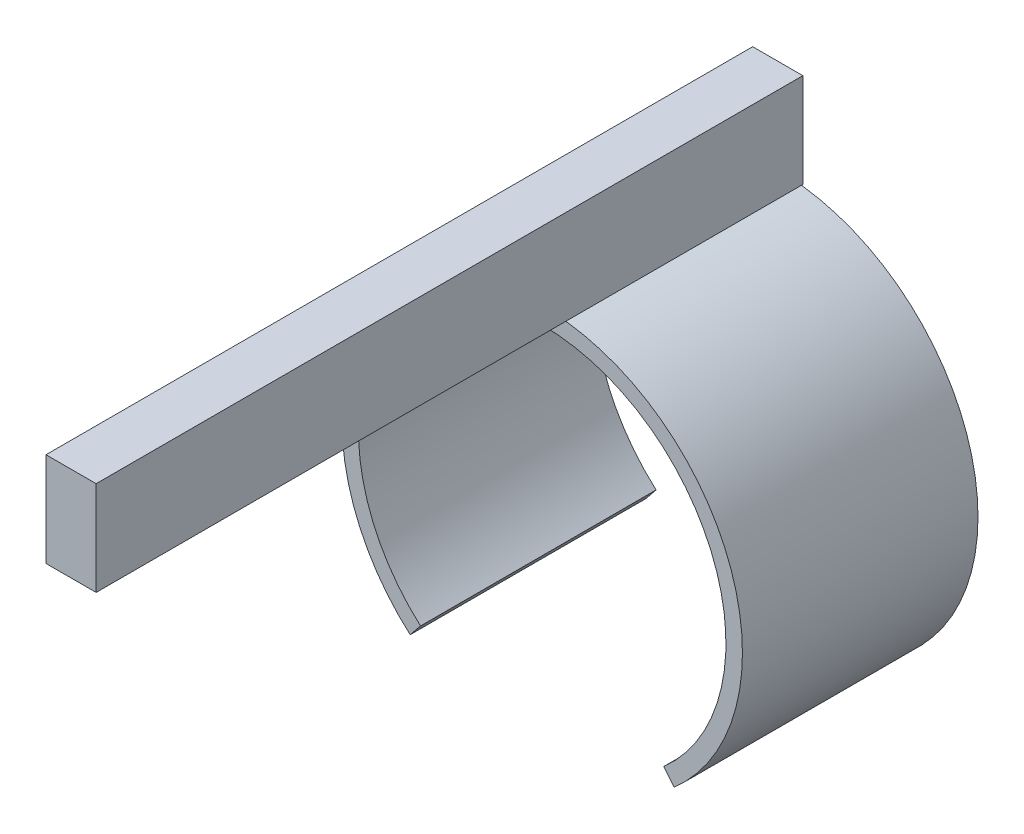
ISO-10303-21;
HEADER;
FILE_DESCRIPTION(('STEP AP214'),'2;1');
FILE_NAME('part.step','',(''),(''),'','','');
FILE_SCHEMA(('AUTOMOTIVE_DESIGN { 1 0 10303 214 1 1 1 1 }'));
ENDSEC;
DATA;
#1=APPLICATION_CONTEXT('core data for automotive mechanical design processes');
#2=APPLICATION_PROTOCOL_DEFINITION('international standard','automotive_design',2000,#1);
#3=PRODUCT_CONTEXT('',#1,'mechanical');
#4=PRODUCT('Part','Part','',(#3));
#5=PRODUCT_RELATED_PRODUCT_CATEGORY('part','',(#4));
#6=PRODUCT_DEFINITION_FORMATION('','',#4);
#7=PRODUCT_DEFINITION_CONTEXT('part definition',#1,'design');
#8=PRODUCT_DEFINITION('design','',#6,#7);
#9=PRODUCT_DEFINITION_SHAPE('','',#8);
#10=(LENGTH_UNIT() NAMED_UNIT(*) SI_UNIT(.MILLI.,.METRE.));
#11=(NAMED_UNIT(*) PLANE_ANGLE_UNIT() SI_UNIT($,.RADIAN.));
#12=(NAMED_UNIT(*) SI_UNIT($,.STERADIAN.) SOLID_ANGLE_UNIT());
#13=UNCERTAINTY_MEASURE_WITH_UNIT(LENGTH_MEASURE(1.E-05),#10,'distance_accuracy_value','');
#14=(GEOMETRIC_REPRESENTATION_CONTEXT(3) GLOBAL_UNCERTAINTY_ASSIGNED_CONTEXT((#13)) GLOBAL_UNIT_ASSIGNED_CONTEXT((#10,
#11,#12)) REPRESENTATION_CONTEXT('',''));
#15=CARTESIAN_POINT('',(0.,0.,0.));
#16=DIRECTION('',(0.,0.,1.));
#17=DIRECTION('',(1.,0.,0.));
#18=AXIS2_PLACEMENT_3D('',#15,#16,#17);
#19=CARTESIAN_POINT('',(-0.532070741142381,6.25,0.));
#20=DIRECTION('',(1.,0.,0.));
#21=DIRECTION('',(0.,0.,-1.));
#22=AXIS2_PLACEMENT_3D('',#19,#20,#21);
#23=PLANE('',#22);
#24=DIRECTION('',(0.,0.,1.));
#25=VECTOR('',#24,1.);
#26=CARTESIAN_POINT('',(-0.532070741142381,4.25,0.));
#27=LINE('',#26,#25);
#28=CARTESIAN_POINT('',(-0.532070741142381,4.25,0.));
#29=VERTEX_POINT('',#28);
#30=CARTESIAN_POINT('',(-0.532070741142381,4.25,15.));
#31=VERTEX_POINT('',#30);
#32=EDGE_CURVE('E91',#29,#31,#27,.T.);
#33=ORIENTED_EDGE('',*,*,#32,.T.);
#34=DIRECTION('',(0.,-1.,0.));
#35=VECTOR('',#34,1.);
#36=CARTESIAN_POINT('',(-0.532070741142381,6.25,15.));
#37=LINE('',#36,#35);
#38=CARTESIAN_POINT('',(-0.532070741142381,6.25,15.));
#39=VERTEX_POINT('',#38);
#40=EDGE_CURVE('E94',#39,#31,#37,.T.);
#41=ORIENTED_EDGE('',*,*,#40,.F.);
#42=DIRECTION('',(0.,0.,1.));
#43=VECTOR('',#42,1.);
#44=CARTESIAN_POINT('',(-0.532070741142381,6.25,0.));
#45=LINE('',#44,#43);
#46=CARTESIAN_POINT('',(-0.532070741142381,6.25,0.));
#47=VERTEX_POINT('',#46);
#48=EDGE_CURVE('E78',#47,#39,#45,.T.);
#49=ORIENTED_EDGE('',*,*,#48,.F.);
#50=DIRECTION('',(0.,-1.,0.));
#51=VECTOR('',#50,1.);
#52=CARTESIAN_POINT('',(-0.532070741142381,6.25,0.));
#53=LINE('',#52,#51);
#54=EDGE_CURVE('E54',#47,#29,#53,.T.);
#55=ORIENTED_EDGE('',*,*,#54,.T.);
#56=EDGE_LOOP('',(#33,#41,#49,#55));
#57=FACE_BOUND('',#56,.T.);
#58=ADVANCED_FACE('F46',(#57),#23,.F.);
#59=CARTESIAN_POINT('',(0.532070741142382,6.25,0.));
#60=DIRECTION('',(-1.,0.,0.));
#61=DIRECTION('',(0.,0.,1.));
#62=AXIS2_PLACEMENT_3D('',#59,#60,#61);
#63=PLANE('',#62);
#64=DIRECTION('',(0.,0.,-1.));
#65=VECTOR('',#64,1.);
#66=CARTESIAN_POINT('',(0.532070741142382,4.25,0.));
#67=LINE('',#66,#65);
#68=CARTESIAN_POINT('',(0.532070741142382,4.25,15.));
#69=VERTEX_POINT('',#68);
#70=CARTESIAN_POINT('',(0.532070741142382,4.25,0.));
#71=VERTEX_POINT('',#70);
#72=EDGE_CURVE('E73',#69,#71,#67,.T.);
#73=ORIENTED_EDGE('',*,*,#72,.T.);
#74=DIRECTION('',(0.,-1.,0.));
#75=VECTOR('',#74,1.);
#76=CARTESIAN_POINT('',(0.532070741142382,6.25,0.));
#77=LINE('',#76,#75);
#78=CARTESIAN_POINT('',(0.532070741142382,6.25,0.));
#79=VERTEX_POINT('',#78);
#80=EDGE_CURVE('E12',#79,#71,#77,.T.);
#81=ORIENTED_EDGE('',*,*,#80,.F.);
#82=DIRECTION('',(0.,0.,-1.));
#83=VECTOR('',#82,1.);
#84=CARTESIAN_POINT('',(0.532070741142382,6.25,0.));
#85=LINE('',#84,#83);
#86=CARTESIAN_POINT('',(0.532070741142382,6.25,15.));
#87=VERTEX_POINT('',#86);
#88=EDGE_CURVE('E112',#87,#79,#85,.T.);
#89=ORIENTED_EDGE('',*,*,#88,.F.);
#90=DIRECTION('',(0.,1.,0.));
#91=VECTOR('',#90,1.);
#92=CARTESIAN_POINT('',(0.532070741142382,4.25,15.));
#93=LINE('',#92,#91);
#94=EDGE_CURVE('E104',#69,#87,#93,.T.);
#95=ORIENTED_EDGE('',*,*,#94,.F.);
#96=EDGE_LOOP('',(#73,#81,#89,#95));
#97=FACE_BOUND('',#96,.T.);
#98=ADVANCED_FACE('F119',(#97),#63,.F.);
#99=CARTESIAN_POINT('',(-0.532070741142381,6.25,0.));
#100=DIRECTION('',(0.,0.,1.));
#101=DIRECTION('',(1.,0.,0.));
#102=AXIS2_PLACEMENT_3D('',#99,#100,#101);
#103=PLANE('',#102);
#104=DIRECTION('',(-1.,0.,0.));
#105=VECTOR('',#104,1.);
#106=CARTESIAN_POINT('',(-0.532070741142381,4.25,0.));
#107=LINE('',#106,#105);
#108=EDGE_CURVE('E113',#71,#29,#107,.T.);
#109=ORIENTED_EDGE('',*,*,#108,.T.);
#110=ORIENTED_EDGE('',*,*,#54,.F.);
#111=DIRECTION('',(-1.,0.,0.));
#112=VECTOR('',#111,1.);
#113=CARTESIAN_POINT('',(-0.532070741142381,6.25,0.));
#114=LINE('',#113,#112);
#115=EDGE_CURVE('E62',#79,#47,#114,.T.);
#116=ORIENTED_EDGE('',*,*,#115,.F.);
#117=ORIENTED_EDGE('',*,*,#80,.T.);
#118=EDGE_LOOP('',(#109,#110,#116,#117));
#119=FACE_BOUND('',#118,.T.);
#120=ADVANCED_FACE('F118',(#119),#103,.F.);
#121=CARTESIAN_POINT('',(0.,6.25,0.));
#122=DIRECTION('',(0.,1.,0.));
#123=DIRECTION('',(0.,0.,1.));
#124=AXIS2_PLACEMENT_3D('',#121,#122,#123);
#125=PLANE('',#124);
#126=ORIENTED_EDGE('',*,*,#48,.T.);
#127=DIRECTION('',(-1.,0.,0.));
#128=VECTOR('',#127,1.);
#129=CARTESIAN_POINT('',(0.532070741142382,6.25,15.));
#130=LINE('',#129,#128);
#131=EDGE_CURVE('E97',#87,#39,#130,.T.);
#132=ORIENTED_EDGE('',*,*,#131,.F.);
#133=ORIENTED_EDGE('',*,*,#88,.T.);
#134=ORIENTED_EDGE('',*,*,#115,.T.);
#135=EDGE_LOOP('',(#126,#132,#133,#134));
#136=FACE_BOUND('',#135,.T.);
#137=ADVANCED_FACE('F120',(#136),#125,.T.);
#138=CARTESIAN_POINT('',(0.,4.25,0.));
#139=DIRECTION('',(0.,1.,0.));
#140=DIRECTION('',(0.,0.,1.));
#141=AXIS2_PLACEMENT_3D('',#138,#139,#140);
#142=PLANE('',#141);
#143=ORIENTED_EDGE('',*,*,#32,.F.);
#144=ORIENTED_EDGE('',*,*,#108,.F.);
#145=ORIENTED_EDGE('',*,*,#72,.F.);
#146=DIRECTION('',(1.,0.,0.));
#147=VECTOR('',#146,1.);
#148=CARTESIAN_POINT('',(-0.532070741142381,4.25,15.));
#149=LINE('',#148,#147);
#150=EDGE_CURVE('E100',#31,#69,#149,.T.);
#151=ORIENTED_EDGE('',*,*,#150,.F.);
#152=EDGE_LOOP('',(#143,#144,#145,#151));
#153=FACE_BOUND('',#152,.T.);
#154=ADVANCED_FACE('F101',(#153),#142,.F.);
#155=CARTESIAN_POINT('',(0.,0.,15.));
#156=DIRECTION('',(0.,0.,1.));
#157=DIRECTION('',(1.,0.,0.));
#158=AXIS2_PLACEMENT_3D('',#155,#156,#157);
#159=PLANE('',#158);
#160=ORIENTED_EDGE('',*,*,#40,.T.);
#161=ORIENTED_EDGE('',*,*,#150,.T.);
#162=ORIENTED_EDGE('',*,*,#94,.T.);
#163=ORIENTED_EDGE('',*,*,#131,.T.);
#164=EDGE_LOOP('',(#160,#161,#162,#163));
#165=FACE_BOUND('',#164,.T.);
#166=ADVANCED_FACE('F106',(#165),#159,.T.);
#167=CLOSED_SHELL('',(#58,#98,#120,#137,#154,#166));
#168=MANIFOLD_SOLID_BREP('B2',#167);
#169=CARTESIAN_POINT('',(0.,0.,5.));
#170=DIRECTION('',(0.,0.,1.));
#171=DIRECTION('',(1.,0.,0.));
#172=AXIS2_PLACEMENT_3D('',#169,#170,#171);
#173=PLANE('',#172);
#174=DIRECTION('',(-0.62975761955806,-0.776791697051768,0.));
#175=VECTOR('',#174,1.);
#176=CARTESIAN_POINT('',(-0.00220406311125276,0.259753332546069,5.));
#177=LINE('',#176,#175);
#178=CARTESIAN_POINT('',(-2.58224659871773,-2.92267044043812,5.));
#179=VERTEX_POINT('',#178);
#180=CARTESIAN_POINT('',(-2.80284365580172,-3.19477189187773,5.));
#181=VERTEX_POINT('',#180);
#182=EDGE_CURVE('E236',#179,#181,#177,.T.);
#183=ORIENTED_EDGE('',*,*,#182,.F.);
#184=CARTESIAN_POINT('',(0.,0.,5.));
#185=DIRECTION('',(0.,0.,1.));
#186=DIRECTION('',(1.,0.,0.));
#187=AXIS2_PLACEMENT_3D('',#184,#185,#186);
#188=CIRCLE('',#187,3.9);
#189=CARTESIAN_POINT('',(2.57967724011712,-2.92493851846868,5.));
#190=VERTEX_POINT('',#189);
#191=EDGE_CURVE('E235',#190,#179,#188,.T.);
#192=ORIENTED_EDGE('',*,*,#191,.F.);
#193=DIRECTION('',(-0.62975761955806,0.776791697051768,0.));
#194=VECTOR('',#193,1.);
#195=CARTESIAN_POINT('',(-0.00220406311125276,0.259753332546069,5.));
#196=LINE('',#195,#194);
#197=CARTESIAN_POINT('',(2.80026683036949,-3.19703075974135,5.));
#198=VERTEX_POINT('',#197);
#199=EDGE_CURVE('E203',#198,#190,#196,.T.);
#200=ORIENTED_EDGE('',*,*,#199,.F.);
#201=CARTESIAN_POINT('',(0.,0.,5.));
#202=DIRECTION('',(0.,0.,1.));
#203=DIRECTION('',(1.,0.,0.));
#204=AXIS2_PLACEMENT_3D('',#201,#202,#203);
#205=CIRCLE('',#204,4.25);
#206=EDGE_CURVE('E232',#198,#181,#205,.T.);
#207=ORIENTED_EDGE('',*,*,#206,.T.);
#208=EDGE_LOOP('',(#183,#192,#200,#207));
#209=FACE_BOUND('',#208,.T.);
#210=ADVANCED_FACE('F181',(#209),#173,.T.);
#211=CARTESIAN_POINT('',(0.,0.,0.));
#212=DIRECTION('',(0.,0.,1.));
#213=DIRECTION('',(1.,0.,0.));
#214=AXIS2_PLACEMENT_3D('',#211,#212,#213);
#215=PLANE('',#214);
#216=CARTESIAN_POINT('',(0.,0.,0.));
#217=DIRECTION('',(0.,0.,1.));
#218=DIRECTION('',(1.,0.,0.));
#219=AXIS2_PLACEMENT_3D('',#216,#217,#218);
#220=CIRCLE('',#219,3.9);
#221=CARTESIAN_POINT('',(2.57967724011712,-2.92493851846868,0.));
#222=VERTEX_POINT('',#221);
#223=CARTESIAN_POINT('',(-2.58224659871773,-2.92267044043812,0.));
#224=VERTEX_POINT('',#223);
#225=EDGE_CURVE('E243',#222,#224,#220,.T.);
#226=ORIENTED_EDGE('',*,*,#225,.T.);
#227=DIRECTION('',(-0.62975761955806,-0.776791697051768,0.));
#228=VECTOR('',#227,1.);
#229=CARTESIAN_POINT('',(-0.00220406311125276,0.259753332546069,0.));
#230=LINE('',#229,#228);
#231=CARTESIAN_POINT('',(-2.80284365580172,-3.19477189187773,0.));
#232=VERTEX_POINT('',#231);
#233=EDGE_CURVE('E195',#224,#232,#230,.T.);
#234=ORIENTED_EDGE('',*,*,#233,.T.);
#235=CARTESIAN_POINT('',(0.,0.,0.));
#236=DIRECTION('',(0.,0.,1.));
#237=DIRECTION('',(1.,0.,0.));
#238=AXIS2_PLACEMENT_3D('',#235,#236,#237);
#239=CIRCLE('',#238,4.25);
#240=CARTESIAN_POINT('',(2.80026683036949,-3.19703075974135,0.));
#241=VERTEX_POINT('',#240);
#242=EDGE_CURVE('E239',#241,#232,#239,.T.);
#243=ORIENTED_EDGE('',*,*,#242,.F.);
#244=DIRECTION('',(-0.62975761955806,0.776791697051768,0.));
#245=VECTOR('',#244,1.);
#246=CARTESIAN_POINT('',(-0.00220406311125276,0.259753332546069,0.));
#247=LINE('',#246,#245);
#248=EDGE_CURVE('E223',#241,#222,#247,.T.);
#249=ORIENTED_EDGE('',*,*,#248,.T.);
#250=EDGE_LOOP('',(#226,#234,#243,#249));
#251=FACE_BOUND('',#250,.T.);
#252=ADVANCED_FACE('F252',(#251),#215,.F.);
#253=CARTESIAN_POINT('',(0.,0.,5.));
#254=DIRECTION('',(0.,0.,-1.));
#255=DIRECTION('',(-1.,0.,0.));
#256=AXIS2_PLACEMENT_3D('',#253,#254,#255);
#257=CYLINDRICAL_SURFACE('',#256,4.25);
#258=DIRECTION('',(0.,0.,-1.));
#259=VECTOR('',#258,1.);
#260=CARTESIAN_POINT('',(-2.80284365580172,-3.19477189187773,5.));
#261=LINE('',#260,#259);
#262=EDGE_CURVE('E227',#232,#181,#261,.F.);
#263=ORIENTED_EDGE('',*,*,#262,.T.);
#264=ORIENTED_EDGE('',*,*,#206,.F.);
#265=DIRECTION('',(0.,0.,-1.));
#266=VECTOR('',#265,1.);
#267=CARTESIAN_POINT('',(2.80026683036949,-3.19703075974135,5.));
#268=LINE('',#267,#266);
#269=EDGE_CURVE('E220',#198,#241,#268,.T.);
#270=ORIENTED_EDGE('',*,*,#269,.T.);
#271=ORIENTED_EDGE('',*,*,#242,.T.);
#272=EDGE_LOOP('',(#263,#264,#270,#271));
#273=FACE_BOUND('',#272,.T.);
#274=ADVANCED_FACE('F183',(#273),#257,.T.);
#275=CARTESIAN_POINT('',(0.,0.,5.));
#276=DIRECTION('',(0.,0.,-1.));
#277=DIRECTION('',(-1.,0.,0.));
#278=AXIS2_PLACEMENT_3D('',#275,#276,#277);
#279=CYLINDRICAL_SURFACE('',#278,3.9);
#280=DIRECTION('',(0.,0.,-1.));
#281=VECTOR('',#280,1.);
#282=CARTESIAN_POINT('',(-2.58224659871773,-2.92267044043812,5.));
#283=LINE('',#282,#281);
#284=EDGE_CURVE('E44',#224,#179,#283,.F.);
#285=ORIENTED_EDGE('',*,*,#284,.F.);
#286=ORIENTED_EDGE('',*,*,#225,.F.);
#287=DIRECTION('',(0.,0.,-1.));
#288=VECTOR('',#287,1.);
#289=CARTESIAN_POINT('',(2.57967724011712,-2.92493851846868,5.));
#290=LINE('',#289,#288);
#291=EDGE_CURVE('E189',#190,#222,#290,.T.);
#292=ORIENTED_EDGE('',*,*,#291,.F.);
#293=ORIENTED_EDGE('',*,*,#191,.T.);
#294=EDGE_LOOP('',(#285,#286,#292,#293));
#295=FACE_BOUND('',#294,.T.);
#296=ADVANCED_FACE('F254',(#295),#279,.F.);
#297=CARTESIAN_POINT('',(-0.00220406311125276,0.259753332546069,0.));
#298=DIRECTION('',(0.776791697051768,0.62975761955806,0.));
#299=DIRECTION('',(-0.62975761955806,0.776791697051768,0.));
#300=AXIS2_PLACEMENT_3D('',#297,#298,#299);
#301=PLANE('',#300);
#302=ORIENTED_EDGE('',*,*,#199,.T.);
#303=ORIENTED_EDGE('',*,*,#291,.T.);
#304=ORIENTED_EDGE('',*,*,#248,.F.);
#305=ORIENTED_EDGE('',*,*,#269,.F.);
#306=EDGE_LOOP('',(#302,#303,#304,#305));
#307=FACE_BOUND('',#306,.T.);
#308=ADVANCED_FACE('F221',(#307),#301,.F.);
#309=CARTESIAN_POINT('',(-0.00220406311125276,0.259753332546069,0.));
#310=DIRECTION('',(-0.776791697051768,0.62975761955806,0.));
#311=DIRECTION('',(-0.62975761955806,-0.776791697051768,0.));
#312=AXIS2_PLACEMENT_3D('',#309,#310,#311);
#313=PLANE('',#312);
#314=ORIENTED_EDGE('',*,*,#233,.F.);
#315=ORIENTED_EDGE('',*,*,#284,.T.);
#316=ORIENTED_EDGE('',*,*,#182,.T.);
#317=ORIENTED_EDGE('',*,*,#262,.F.);
#318=EDGE_LOOP('',(#314,#315,#316,#317));
#319=FACE_BOUND('',#318,.T.);
#320=ADVANCED_FACE('F255',(#319),#313,.F.);
#321=CLOSED_SHELL('',(#210,#252,#274,#296,#308,#320));
#322=MANIFOLD_SOLID_BREP('B6',#321);
#323=ADVANCED_BREP_SHAPE_REPRESENTATION('',(#18,#168,#322),#14);
#324=SHAPE_DEFINITION_REPRESENTATION(#9,#323);
ENDSEC;
END-ISO-10303-21;
